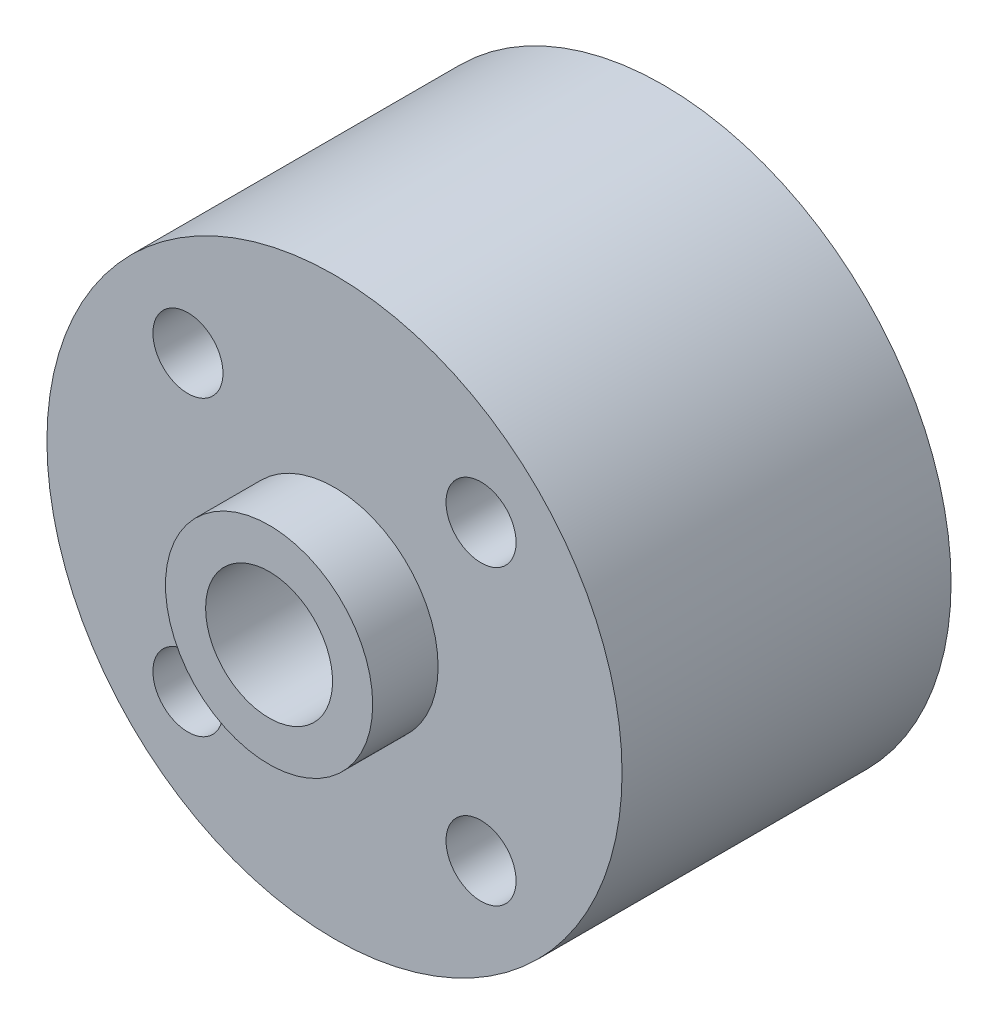
ISO-10303-21;
HEADER;
FILE_DESCRIPTION(('STEP AP214'),'2;1');
FILE_NAME('part.step','',(''),(''),'','','');
FILE_SCHEMA(('AUTOMOTIVE_DESIGN { 1 0 10303 214 1 1 1 1 }'));
ENDSEC;
DATA;
#1=APPLICATION_CONTEXT('core data for automotive mechanical design processes');
#2=APPLICATION_PROTOCOL_DEFINITION('international standard','automotive_design',2000,#1);
#3=PRODUCT_CONTEXT('',#1,'mechanical');
#4=PRODUCT('Part','Part','',(#3));
#5=PRODUCT_RELATED_PRODUCT_CATEGORY('part','',(#4));
#6=PRODUCT_DEFINITION_FORMATION('','',#4);
#7=PRODUCT_DEFINITION_CONTEXT('part definition',#1,'design');
#8=PRODUCT_DEFINITION('design','',#6,#7);
#9=PRODUCT_DEFINITION_SHAPE('','',#8);
#10=(LENGTH_UNIT() NAMED_UNIT(*) SI_UNIT(.MILLI.,.METRE.));
#11=(NAMED_UNIT(*) PLANE_ANGLE_UNIT() SI_UNIT($,.RADIAN.));
#12=(NAMED_UNIT(*) SI_UNIT($,.STERADIAN.) SOLID_ANGLE_UNIT());
#13=UNCERTAINTY_MEASURE_WITH_UNIT(LENGTH_MEASURE(1.E-05),#10,'distance_accuracy_value','');
#14=(GEOMETRIC_REPRESENTATION_CONTEXT(3) GLOBAL_UNCERTAINTY_ASSIGNED_CONTEXT((#13)) GLOBAL_UNIT_ASSIGNED_CONTEXT((#10,
#11,#12)) REPRESENTATION_CONTEXT('',''));
#15=CARTESIAN_POINT('',(0.,0.,0.));
#16=DIRECTION('',(0.,0.,1.));
#17=DIRECTION('',(1.,0.,0.));
#18=AXIS2_PLACEMENT_3D('',#15,#16,#17);
#19=CARTESIAN_POINT('',(0.,0.,6.35));
#20=DIRECTION('',(0.,0.,1.));
#21=DIRECTION('',(1.,0.,0.));
#22=AXIS2_PLACEMENT_3D('',#19,#20,#21);
#23=PLANE('',#22);
#24=CARTESIAN_POINT('',(5.656854249492,5.656854249492,6.35));
#25=DIRECTION('',(0.,0.,1.));
#26=DIRECTION('',(1.,0.,0.));
#27=AXIS2_PLACEMENT_3D('',#24,#25,#26);
#28=CIRCLE('',#27,1.35249999999999);
#29=CARTESIAN_POINT('',(7.00935424949199,5.656854249492,6.35));
#30=VERTEX_POINT('',#29);
#31=EDGE_CURVE('E135',#30,#30,#28,.T.);
#32=ORIENTED_EDGE('',*,*,#31,.F.);
#33=EDGE_LOOP('',(#32));
#34=FACE_BOUND('',#33,.T.);
#35=CARTESIAN_POINT('',(-5.656854249492,5.656854249492,6.35));
#36=DIRECTION('',(0.,0.,1.));
#37=DIRECTION('',(1.,0.,0.));
#38=AXIS2_PLACEMENT_3D('',#35,#36,#37);
#39=CIRCLE('',#38,1.35249999999999);
#40=CARTESIAN_POINT('',(-4.30435424949201,5.656854249492,6.35));
#41=VERTEX_POINT('',#40);
#42=EDGE_CURVE('E61',#41,#41,#39,.T.);
#43=ORIENTED_EDGE('',*,*,#42,.F.);
#44=EDGE_LOOP('',(#43));
#45=FACE_BOUND('',#44,.T.);
#46=CARTESIAN_POINT('',(-5.656854249492,-5.656854249492,6.35));
#47=DIRECTION('',(0.,0.,1.));
#48=DIRECTION('',(1.,0.,0.));
#49=AXIS2_PLACEMENT_3D('',#46,#47,#48);
#50=CIRCLE('',#49,1.35249999999999);
#51=CARTESIAN_POINT('',(-4.30435424949201,-5.656854249492,6.35));
#52=VERTEX_POINT('',#51);
#53=EDGE_CURVE('E49',#52,#52,#50,.T.);
#54=ORIENTED_EDGE('',*,*,#53,.F.);
#55=EDGE_LOOP('',(#54));
#56=FACE_BOUND('',#55,.T.);
#57=CARTESIAN_POINT('',(5.656854249492,-5.656854249492,6.35));
#58=DIRECTION('',(0.,0.,1.));
#59=DIRECTION('',(1.,0.,0.));
#60=AXIS2_PLACEMENT_3D('',#57,#58,#59);
#61=CIRCLE('',#60,1.35249999999999);
#62=CARTESIAN_POINT('',(7.00935424949199,-5.656854249492,6.35));
#63=VERTEX_POINT('',#62);
#64=EDGE_CURVE('E48',#63,#63,#61,.T.);
#65=ORIENTED_EDGE('',*,*,#64,.F.);
#66=EDGE_LOOP('',(#65));
#67=FACE_BOUND('',#66,.T.);
#68=CARTESIAN_POINT('',(0.,0.,6.35));
#69=DIRECTION('',(0.,0.,1.));
#70=DIRECTION('',(1.,0.,0.));
#71=AXIS2_PLACEMENT_3D('',#68,#69,#70);
#72=CIRCLE('',#71,11.1);
#73=CARTESIAN_POINT('',(11.1,0.,6.35));
#74=VERTEX_POINT('',#73);
#75=EDGE_CURVE('E38',#74,#74,#72,.T.);
#76=ORIENTED_EDGE('',*,*,#75,.T.);
#77=EDGE_LOOP('',(#76));
#78=FACE_BOUND('',#77,.T.);
#79=CARTESIAN_POINT('',(0.,0.,6.35));
#80=DIRECTION('',(0.,0.,1.));
#81=DIRECTION('',(1.,0.,0.));
#82=AXIS2_PLACEMENT_3D('',#79,#80,#81);
#83=CIRCLE('',#82,4.);
#84=CARTESIAN_POINT('',(4.,0.,6.35));
#85=VERTEX_POINT('',#84);
#86=EDGE_CURVE('E67',#85,#85,#83,.T.);
#87=ORIENTED_EDGE('',*,*,#86,.F.);
#88=EDGE_LOOP('',(#87));
#89=FACE_BOUND('',#88,.T.);
#90=ADVANCED_FACE('F30',(#34,#45,#56,#67,#78,#89),#23,.T.);
#91=CARTESIAN_POINT('',(11.1,0.,-6.35));
#92=DIRECTION('',(0.,0.,-1.));
#93=DIRECTION('',(-1.,0.,0.));
#94=AXIS2_PLACEMENT_3D('',#91,#92,#93);
#95=PLANE('',#94);
#96=CARTESIAN_POINT('',(5.656854249492,5.656854249492,-6.35));
#97=DIRECTION('',(0.,0.,-1.));
#98=DIRECTION('',(-1.,0.,0.));
#99=AXIS2_PLACEMENT_3D('',#96,#97,#98);
#100=CIRCLE('',#99,1.35249999999999);
#101=CARTESIAN_POINT('',(4.30435424949201,5.656854249492,-6.35));
#102=VERTEX_POINT('',#101);
#103=EDGE_CURVE('E34',#102,#102,#100,.T.);
#104=ORIENTED_EDGE('',*,*,#103,.F.);
#105=EDGE_LOOP('',(#104));
#106=FACE_BOUND('',#105,.T.);
#107=CARTESIAN_POINT('',(-5.656854249492,5.656854249492,-6.35));
#108=DIRECTION('',(0.,0.,-1.));
#109=DIRECTION('',(-1.,0.,0.));
#110=AXIS2_PLACEMENT_3D('',#107,#108,#109);
#111=CIRCLE('',#110,1.35249999999999);
#112=CARTESIAN_POINT('',(-7.00935424949199,5.656854249492,-6.35));
#113=VERTEX_POINT('',#112);
#114=EDGE_CURVE('E56',#113,#113,#111,.T.);
#115=ORIENTED_EDGE('',*,*,#114,.F.);
#116=EDGE_LOOP('',(#115));
#117=FACE_BOUND('',#116,.T.);
#118=CARTESIAN_POINT('',(-5.656854249492,-5.656854249492,-6.35));
#119=DIRECTION('',(0.,0.,-1.));
#120=DIRECTION('',(-1.,0.,0.));
#121=AXIS2_PLACEMENT_3D('',#118,#119,#120);
#122=CIRCLE('',#121,1.35249999999999);
#123=CARTESIAN_POINT('',(-7.00935424949199,-5.656854249492,-6.35));
#124=VERTEX_POINT('',#123);
#125=EDGE_CURVE('E46',#124,#124,#122,.T.);
#126=ORIENTED_EDGE('',*,*,#125,.F.);
#127=EDGE_LOOP('',(#126));
#128=FACE_BOUND('',#127,.T.);
#129=CARTESIAN_POINT('',(5.656854249492,-5.656854249492,-6.35));
#130=DIRECTION('',(0.,0.,-1.));
#131=DIRECTION('',(-1.,0.,0.));
#132=AXIS2_PLACEMENT_3D('',#129,#130,#131);
#133=CIRCLE('',#132,1.35249999999999);
#134=CARTESIAN_POINT('',(4.30435424949201,-5.656854249492,-6.35));
#135=VERTEX_POINT('',#134);
#136=EDGE_CURVE('E53',#135,#135,#133,.T.);
#137=ORIENTED_EDGE('',*,*,#136,.F.);
#138=EDGE_LOOP('',(#137));
#139=FACE_BOUND('',#138,.T.);
#140=CARTESIAN_POINT('',(0.,0.,-6.35));
#141=DIRECTION('',(0.,0.,1.));
#142=DIRECTION('',(1.,0.,0.));
#143=AXIS2_PLACEMENT_3D('',#140,#141,#142);
#144=CIRCLE('',#143,11.1);
#145=CARTESIAN_POINT('',(11.1,0.,-6.35));
#146=VERTEX_POINT('',#145);
#147=EDGE_CURVE('E10',#146,#146,#144,.T.);
#148=ORIENTED_EDGE('',*,*,#147,.F.);
#149=EDGE_LOOP('',(#148));
#150=FACE_BOUND('',#149,.T.);
#151=CARTESIAN_POINT('',(0.,0.,-6.35));
#152=DIRECTION('',(0.,0.,-1.));
#153=DIRECTION('',(-1.,0.,0.));
#154=AXIS2_PLACEMENT_3D('',#151,#152,#153);
#155=CIRCLE('',#154,4.);
#156=CARTESIAN_POINT('',(-4.,0.,-6.35));
#157=VERTEX_POINT('',#156);
#158=EDGE_CURVE('E71',#157,#157,#155,.T.);
#159=ORIENTED_EDGE('',*,*,#158,.F.);
#160=EDGE_LOOP('',(#159));
#161=FACE_BOUND('',#160,.T.);
#162=ADVANCED_FACE('F80',(#106,#117,#128,#139,#150,#161),#95,.T.);
#163=CARTESIAN_POINT('',(0.,0.,-6.35));
#164=DIRECTION('',(0.,0.,1.));
#165=DIRECTION('',(1.,0.,0.));
#166=AXIS2_PLACEMENT_3D('',#163,#164,#165);
#167=CYLINDRICAL_SURFACE('',#166,11.1);
#168=ORIENTED_EDGE('',*,*,#147,.T.);
#169=EDGE_LOOP('',(#168));
#170=FACE_BOUND('',#169,.T.);
#171=ORIENTED_EDGE('',*,*,#75,.F.);
#172=EDGE_LOOP('',(#171));
#173=FACE_BOUND('',#172,.T.);
#174=ADVANCED_FACE('F32',(#170,#173),#167,.T.);
#175=CARTESIAN_POINT('',(0.,0.,-8.875));
#176=DIRECTION('',(0.,0.,1.));
#177=DIRECTION('',(1.,0.,0.));
#178=AXIS2_PLACEMENT_3D('',#175,#176,#177);
#179=CYLINDRICAL_SURFACE('',#178,4.);
#180=CARTESIAN_POINT('',(0.,0.,-8.875));
#181=DIRECTION('',(0.,0.,-1.));
#182=DIRECTION('',(-1.,0.,0.));
#183=AXIS2_PLACEMENT_3D('',#180,#181,#182);
#184=CIRCLE('',#183,4.);
#185=CARTESIAN_POINT('',(-4.,0.,-8.875));
#186=VERTEX_POINT('',#185);
#187=EDGE_CURVE('E43',#186,#186,#184,.T.);
#188=ORIENTED_EDGE('',*,*,#187,.F.);
#189=EDGE_LOOP('',(#188));
#190=FACE_BOUND('',#189,.T.);
#191=ORIENTED_EDGE('',*,*,#158,.T.);
#192=EDGE_LOOP('',(#191));
#193=FACE_BOUND('',#192,.T.);
#194=ADVANCED_FACE('F78',(#190,#193),#179,.T.);
#195=CARTESIAN_POINT('',(0.,0.,-8.875));
#196=DIRECTION('',(0.,0.,-1.));
#197=DIRECTION('',(-1.,0.,0.));
#198=AXIS2_PLACEMENT_3D('',#195,#196,#197);
#199=PLANE('',#198);
#200=CARTESIAN_POINT('',(0.,0.,-8.875));
#201=DIRECTION('',(0.,0.,-1.));
#202=DIRECTION('',(-1.,0.,0.));
#203=AXIS2_PLACEMENT_3D('',#200,#201,#202);
#204=CIRCLE('',#203,2.44999999999999);
#205=CARTESIAN_POINT('',(-2.44999999999999,0.,-8.875));
#206=VERTEX_POINT('',#205);
#207=EDGE_CURVE('E133',#206,#206,#204,.T.);
#208=ORIENTED_EDGE('',*,*,#207,.F.);
#209=EDGE_LOOP('',(#208));
#210=FACE_BOUND('',#209,.T.);
#211=ORIENTED_EDGE('',*,*,#187,.T.);
#212=EDGE_LOOP('',(#211));
#213=FACE_BOUND('',#212,.T.);
#214=ADVANCED_FACE('F94',(#210,#213),#199,.T.);
#215=CARTESIAN_POINT('',(0.,0.,8.875));
#216=DIRECTION('',(0.,0.,-1.));
#217=DIRECTION('',(-1.,0.,0.));
#218=AXIS2_PLACEMENT_3D('',#215,#216,#217);
#219=CYLINDRICAL_SURFACE('',#218,4.);
#220=CARTESIAN_POINT('',(0.,0.,8.875));
#221=DIRECTION('',(0.,0.,1.));
#222=DIRECTION('',(1.,0.,0.));
#223=AXIS2_PLACEMENT_3D('',#220,#221,#222);
#224=CIRCLE('',#223,4.);
#225=CARTESIAN_POINT('',(4.,0.,8.875));
#226=VERTEX_POINT('',#225);
#227=EDGE_CURVE('E68',#226,#226,#224,.T.);
#228=ORIENTED_EDGE('',*,*,#227,.F.);
#229=EDGE_LOOP('',(#228));
#230=FACE_BOUND('',#229,.T.);
#231=ORIENTED_EDGE('',*,*,#86,.T.);
#232=EDGE_LOOP('',(#231));
#233=FACE_BOUND('',#232,.T.);
#234=ADVANCED_FACE('F98',(#230,#233),#219,.T.);
#235=CARTESIAN_POINT('',(0.,0.,8.875));
#236=DIRECTION('',(0.,0.,1.));
#237=DIRECTION('',(1.,0.,0.));
#238=AXIS2_PLACEMENT_3D('',#235,#236,#237);
#239=PLANE('',#238);
#240=CARTESIAN_POINT('',(0.,0.,8.875));
#241=DIRECTION('',(0.,0.,-1.));
#242=DIRECTION('',(-1.,0.,0.));
#243=AXIS2_PLACEMENT_3D('',#240,#241,#242);
#244=CIRCLE('',#243,2.44999999999999);
#245=CARTESIAN_POINT('',(-2.44999999999999,0.,8.875));
#246=VERTEX_POINT('',#245);
#247=EDGE_CURVE('E130',#246,#246,#244,.T.);
#248=ORIENTED_EDGE('',*,*,#247,.T.);
#249=EDGE_LOOP('',(#248));
#250=FACE_BOUND('',#249,.T.);
#251=ORIENTED_EDGE('',*,*,#227,.T.);
#252=EDGE_LOOP('',(#251));
#253=FACE_BOUND('',#252,.T.);
#254=ADVANCED_FACE('F102',(#250,#253),#239,.T.);
#255=CARTESIAN_POINT('',(5.656854249492,-5.656854249492,6.35));
#256=DIRECTION('',(0.,0.,1.));
#257=DIRECTION('',(1.,0.,0.));
#258=AXIS2_PLACEMENT_3D('',#255,#256,#257);
#259=CYLINDRICAL_SURFACE('',#258,1.35249999999999);
#260=ORIENTED_EDGE('',*,*,#136,.T.);
#261=EDGE_LOOP('',(#260));
#262=FACE_BOUND('',#261,.T.);
#263=ORIENTED_EDGE('',*,*,#64,.T.);
#264=EDGE_LOOP('',(#263));
#265=FACE_BOUND('',#264,.T.);
#266=ADVANCED_FACE('F106',(#262,#265),#259,.F.);
#267=CARTESIAN_POINT('',(-5.656854249492,-5.656854249492,6.35));
#268=DIRECTION('',(0.,0.,1.));
#269=DIRECTION('',(1.,0.,0.));
#270=AXIS2_PLACEMENT_3D('',#267,#268,#269);
#271=CYLINDRICAL_SURFACE('',#270,1.35249999999999);
#272=ORIENTED_EDGE('',*,*,#125,.T.);
#273=EDGE_LOOP('',(#272));
#274=FACE_BOUND('',#273,.T.);
#275=ORIENTED_EDGE('',*,*,#53,.T.);
#276=EDGE_LOOP('',(#275));
#277=FACE_BOUND('',#276,.T.);
#278=ADVANCED_FACE('F110',(#274,#277),#271,.F.);
#279=CARTESIAN_POINT('',(-5.656854249492,5.656854249492,6.35));
#280=DIRECTION('',(0.,0.,1.));
#281=DIRECTION('',(1.,0.,0.));
#282=AXIS2_PLACEMENT_3D('',#279,#280,#281);
#283=CYLINDRICAL_SURFACE('',#282,1.35249999999999);
#284=ORIENTED_EDGE('',*,*,#114,.T.);
#285=EDGE_LOOP('',(#284));
#286=FACE_BOUND('',#285,.T.);
#287=ORIENTED_EDGE('',*,*,#42,.T.);
#288=EDGE_LOOP('',(#287));
#289=FACE_BOUND('',#288,.T.);
#290=ADVANCED_FACE('F114',(#286,#289),#283,.F.);
#291=CARTESIAN_POINT('',(5.656854249492,5.656854249492,6.35));
#292=DIRECTION('',(0.,0.,1.));
#293=DIRECTION('',(1.,0.,0.));
#294=AXIS2_PLACEMENT_3D('',#291,#292,#293);
#295=CYLINDRICAL_SURFACE('',#294,1.35249999999999);
#296=ORIENTED_EDGE('',*,*,#103,.T.);
#297=EDGE_LOOP('',(#296));
#298=FACE_BOUND('',#297,.T.);
#299=ORIENTED_EDGE('',*,*,#31,.T.);
#300=EDGE_LOOP('',(#299));
#301=FACE_BOUND('',#300,.T.);
#302=ADVANCED_FACE('F117',(#298,#301),#295,.F.);
#303=CARTESIAN_POINT('',(0.,0.,-8.875));
#304=DIRECTION('',(0.,0.,-1.));
#305=DIRECTION('',(-1.,0.,0.));
#306=AXIS2_PLACEMENT_3D('',#303,#304,#305);
#307=CYLINDRICAL_SURFACE('',#306,2.44999999999999);
#308=ORIENTED_EDGE('',*,*,#247,.F.);
#309=EDGE_LOOP('',(#308));
#310=FACE_BOUND('',#309,.T.);
#311=ORIENTED_EDGE('',*,*,#207,.T.);
#312=EDGE_LOOP('',(#311));
#313=FACE_BOUND('',#312,.T.);
#314=ADVANCED_FACE('F121',(#310,#313),#307,.F.);
#315=CLOSED_SHELL('',(#90,#162,#174,#194,#214,#234,#254,#266,#278,#290,#302,#314));
#316=MANIFOLD_SOLID_BREP('B2',#315);
#317=ADVANCED_BREP_SHAPE_REPRESENTATION('',(#18,#316),#14);
#318=SHAPE_DEFINITION_REPRESENTATION(#9,#317);
ENDSEC;
END-ISO-10303-21;
